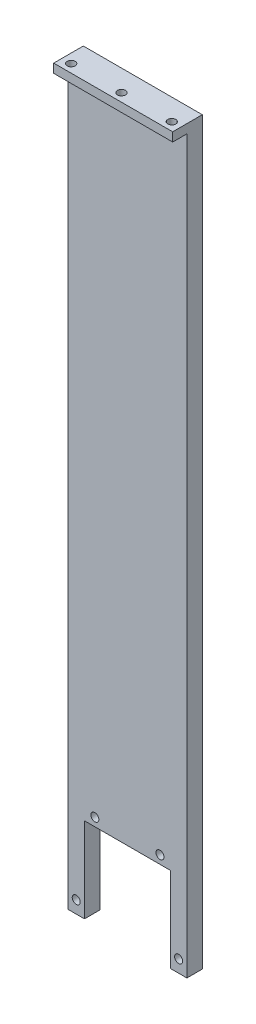
ISO-10303-21;
HEADER;
FILE_DESCRIPTION(('STEP AP214'),'2;1');
FILE_NAME('part.step','',(''),(''),'','','');
FILE_SCHEMA(('AUTOMOTIVE_DESIGN { 1 0 10303 214 1 1 1 1 }'));
ENDSEC;
DATA;
#1=APPLICATION_CONTEXT('core data for automotive mechanical design processes');
#2=APPLICATION_PROTOCOL_DEFINITION('international standard','automotive_design',2000,#1);
#3=PRODUCT_CONTEXT('',#1,'mechanical');
#4=PRODUCT('Part','Part','',(#3));
#5=PRODUCT_RELATED_PRODUCT_CATEGORY('part','',(#4));
#6=PRODUCT_DEFINITION_FORMATION('','',#4);
#7=PRODUCT_DEFINITION_CONTEXT('part definition',#1,'design');
#8=PRODUCT_DEFINITION('design','',#6,#7);
#9=PRODUCT_DEFINITION_SHAPE('','',#8);
#10=(LENGTH_UNIT() NAMED_UNIT(*) SI_UNIT(.MILLI.,.METRE.));
#11=(NAMED_UNIT(*) PLANE_ANGLE_UNIT() SI_UNIT($,.RADIAN.));
#12=(NAMED_UNIT(*) SI_UNIT($,.STERADIAN.) SOLID_ANGLE_UNIT());
#13=UNCERTAINTY_MEASURE_WITH_UNIT(LENGTH_MEASURE(1.E-05),#10,'distance_accuracy_value','');
#14=(GEOMETRIC_REPRESENTATION_CONTEXT(3) GLOBAL_UNCERTAINTY_ASSIGNED_CONTEXT((#13)) GLOBAL_UNIT_ASSIGNED_CONTEXT((#10,
#11,#12)) REPRESENTATION_CONTEXT('',''));
#15=CARTESIAN_POINT('',(0.,0.,0.));
#16=DIRECTION('',(0.,0.,1.));
#17=DIRECTION('',(1.,0.,0.));
#18=AXIS2_PLACEMENT_3D('',#15,#16,#17);
#19=CARTESIAN_POINT('',(-20.1,-125.,10.));
#20=DIRECTION('',(0.,1.,0.));
#21=DIRECTION('',(0.,0.,1.));
#22=AXIS2_PLACEMENT_3D('',#19,#20,#21);
#23=PLANE('',#22);
#24=DIRECTION('',(1.,0.,0.));
#25=VECTOR('',#24,1.);
#26=CARTESIAN_POINT('',(-20.1,-125.,5.2));
#27=LINE('',#26,#25);
#28=CARTESIAN_POINT('',(14.5,-125.,5.2));
#29=VERTEX_POINT('',#28);
#30=CARTESIAN_POINT('',(20.1,-125.,5.2));
#31=VERTEX_POINT('',#30);
#32=EDGE_CURVE('E152',#29,#31,#27,.T.);
#33=ORIENTED_EDGE('',*,*,#32,.F.);
#34=DIRECTION('',(0.,0.,1.));
#35=VECTOR('',#34,1.);
#36=CARTESIAN_POINT('',(14.5,-125.,0.));
#37=LINE('',#36,#35);
#38=CARTESIAN_POINT('',(14.5,-125.,0.));
#39=VERTEX_POINT('',#38);
#40=EDGE_CURVE('E137',#39,#29,#37,.T.);
#41=ORIENTED_EDGE('',*,*,#40,.F.);
#42=DIRECTION('',(1.,0.,0.));
#43=VECTOR('',#42,1.);
#44=CARTESIAN_POINT('',(-20.1,-125.,0.));
#45=LINE('',#44,#43);
#46=CARTESIAN_POINT('',(20.1,-125.,0.));
#47=VERTEX_POINT('',#46);
#48=EDGE_CURVE('E127',#39,#47,#45,.T.);
#49=ORIENTED_EDGE('',*,*,#48,.T.);
#50=DIRECTION('',(0.,0.,-1.));
#51=VECTOR('',#50,1.);
#52=CARTESIAN_POINT('',(20.1,-125.,10.));
#53=LINE('',#52,#51);
#54=EDGE_CURVE('E170',#31,#47,#53,.T.);
#55=ORIENTED_EDGE('',*,*,#54,.F.);
#56=EDGE_LOOP('',(#33,#41,#49,#55));
#57=FACE_BOUND('',#56,.T.);
#58=ADVANCED_FACE('F31',(#57),#23,.F.);
#59=CARTESIAN_POINT('',(-20.1,-125.,0.));
#60=VERTEX_POINT('',#59);
#61=CARTESIAN_POINT('',(-14.5,-125.,0.));
#62=VERTEX_POINT('',#61);
#63=EDGE_CURVE('E165',#60,#62,#45,.T.);
#64=ORIENTED_EDGE('',*,*,#63,.T.);
#65=DIRECTION('',(0.,0.,1.));
#66=VECTOR('',#65,1.);
#67=CARTESIAN_POINT('',(-14.5,-125.,0.));
#68=LINE('',#67,#66);
#69=CARTESIAN_POINT('',(-14.5,-125.,5.2));
#70=VERTEX_POINT('',#69);
#71=EDGE_CURVE('E140',#62,#70,#68,.T.);
#72=ORIENTED_EDGE('',*,*,#71,.T.);
#73=CARTESIAN_POINT('',(-20.1,-125.,5.2));
#74=VERTEX_POINT('',#73);
#75=EDGE_CURVE('E153',#74,#70,#27,.T.);
#76=ORIENTED_EDGE('',*,*,#75,.F.);
#77=DIRECTION('',(0.,0.,-1.));
#78=VECTOR('',#77,1.);
#79=CARTESIAN_POINT('',(-20.1,-125.,10.));
#80=LINE('',#79,#78);
#81=EDGE_CURVE('E182',#74,#60,#80,.T.);
#82=ORIENTED_EDGE('',*,*,#81,.T.);
#83=EDGE_LOOP('',(#64,#72,#76,#82));
#84=FACE_BOUND('',#83,.T.);
#85=ADVANCED_FACE('F247',(#84),#23,.F.);
#86=CARTESIAN_POINT('',(20.1,-125.,10.));
#87=DIRECTION('',(-1.,0.,0.));
#88=DIRECTION('',(0.,0.,1.));
#89=AXIS2_PLACEMENT_3D('',#86,#87,#88);
#90=PLANE('',#89);
#91=DIRECTION('',(0.,1.,0.));
#92=VECTOR('',#91,1.);
#93=CARTESIAN_POINT('',(20.1,-125.,10.));
#94=LINE('',#93,#92);
#95=CARTESIAN_POINT('',(20.1,122.,10.));
#96=VERTEX_POINT('',#95);
#97=CARTESIAN_POINT('',(20.1,125.,10.));
#98=VERTEX_POINT('',#97);
#99=EDGE_CURVE('E162',#96,#98,#94,.T.);
#100=ORIENTED_EDGE('',*,*,#99,.F.);
#101=DIRECTION('',(0.,0.,1.));
#102=VECTOR('',#101,1.);
#103=CARTESIAN_POINT('',(20.1,122.,5.2));
#104=LINE('',#103,#102);
#105=CARTESIAN_POINT('',(20.1,122.,5.2));
#106=VERTEX_POINT('',#105);
#107=EDGE_CURVE('E55',#106,#96,#104,.T.);
#108=ORIENTED_EDGE('',*,*,#107,.F.);
#109=DIRECTION('',(0.,1.,0.));
#110=VECTOR('',#109,1.);
#111=CARTESIAN_POINT('',(20.1,122.,5.2));
#112=LINE('',#111,#110);
#113=EDGE_CURVE('E144',#31,#106,#112,.T.);
#114=ORIENTED_EDGE('',*,*,#113,.F.);
#115=ORIENTED_EDGE('',*,*,#54,.T.);
#116=DIRECTION('',(0.,1.,0.));
#117=VECTOR('',#116,1.);
#118=CARTESIAN_POINT('',(20.1,-125.,0.));
#119=LINE('',#118,#117);
#120=CARTESIAN_POINT('',(20.1,125.,0.));
#121=VERTEX_POINT('',#120);
#122=EDGE_CURVE('E160',#47,#121,#119,.T.);
#123=ORIENTED_EDGE('',*,*,#122,.T.);
#124=DIRECTION('',(0.,0.,-1.));
#125=VECTOR('',#124,1.);
#126=CARTESIAN_POINT('',(20.1,125.,10.));
#127=LINE('',#126,#125);
#128=EDGE_CURVE('E187',#98,#121,#127,.T.);
#129=ORIENTED_EDGE('',*,*,#128,.F.);
#130=EDGE_LOOP('',(#100,#108,#114,#115,#123,#129));
#131=FACE_BOUND('',#130,.T.);
#132=ADVANCED_FACE('F33',(#131),#90,.F.);
#133=CARTESIAN_POINT('',(-20.1,125.,10.));
#134=DIRECTION('',(0.,-1.,0.));
#135=DIRECTION('',(0.,0.,-1.));
#136=AXIS2_PLACEMENT_3D('',#133,#134,#135);
#137=PLANE('',#136);
#138=CARTESIAN_POINT('',(0.,125.,7.2));
#139=DIRECTION('',(0.,1.,0.));
#140=DIRECTION('',(0.,0.,1.));
#141=AXIS2_PLACEMENT_3D('',#138,#139,#140);
#142=CIRCLE('',#141,1.35);
#143=CARTESIAN_POINT('',(0.,125.,8.55));
#144=VERTEX_POINT('',#143);
#145=EDGE_CURVE('E220',#144,#144,#142,.T.);
#146=ORIENTED_EDGE('',*,*,#145,.F.);
#147=EDGE_LOOP('',(#146));
#148=FACE_BOUND('',#147,.T.);
#149=CARTESIAN_POINT('',(-17.,125.,7.2));
#150=DIRECTION('',(0.,1.,0.));
#151=DIRECTION('',(0.,0.,1.));
#152=AXIS2_PLACEMENT_3D('',#149,#150,#151);
#153=CIRCLE('',#152,1.35);
#154=CARTESIAN_POINT('',(-17.,125.,8.55));
#155=VERTEX_POINT('',#154);
#156=EDGE_CURVE('E210',#155,#155,#153,.T.);
#157=ORIENTED_EDGE('',*,*,#156,.F.);
#158=EDGE_LOOP('',(#157));
#159=FACE_BOUND('',#158,.T.);
#160=CARTESIAN_POINT('',(17.,125.,7.2));
#161=DIRECTION('',(0.,1.,0.));
#162=DIRECTION('',(0.,0.,1.));
#163=AXIS2_PLACEMENT_3D('',#160,#161,#162);
#164=CIRCLE('',#163,1.35);
#165=CARTESIAN_POINT('',(17.,125.,8.55));
#166=VERTEX_POINT('',#165);
#167=EDGE_CURVE('E207',#166,#166,#164,.T.);
#168=ORIENTED_EDGE('',*,*,#167,.F.);
#169=EDGE_LOOP('',(#168));
#170=FACE_BOUND('',#169,.T.);
#171=DIRECTION('',(-1.,0.,0.));
#172=VECTOR('',#171,1.);
#173=CARTESIAN_POINT('',(-20.1,125.,0.));
#174=LINE('',#173,#172);
#175=CARTESIAN_POINT('',(-20.1,125.,0.));
#176=VERTEX_POINT('',#175);
#177=EDGE_CURVE('E173',#121,#176,#174,.T.);
#178=ORIENTED_EDGE('',*,*,#177,.T.);
#179=DIRECTION('',(0.,0.,-1.));
#180=VECTOR('',#179,1.);
#181=CARTESIAN_POINT('',(-20.1,125.,10.));
#182=LINE('',#181,#180);
#183=CARTESIAN_POINT('',(-20.1,125.,10.));
#184=VERTEX_POINT('',#183);
#185=EDGE_CURVE('E184',#184,#176,#182,.T.);
#186=ORIENTED_EDGE('',*,*,#185,.F.);
#187=DIRECTION('',(-1.,0.,0.));
#188=VECTOR('',#187,1.);
#189=CARTESIAN_POINT('',(-20.1,125.,10.));
#190=LINE('',#189,#188);
#191=EDGE_CURVE('E164',#98,#184,#190,.T.);
#192=ORIENTED_EDGE('',*,*,#191,.F.);
#193=ORIENTED_EDGE('',*,*,#128,.T.);
#194=EDGE_LOOP('',(#178,#186,#192,#193));
#195=FACE_BOUND('',#194,.T.);
#196=ADVANCED_FACE('F261',(#148,#159,#170,#195),#137,.F.);
#197=CARTESIAN_POINT('',(-20.1,-125.,10.));
#198=DIRECTION('',(1.,0.,0.));
#199=DIRECTION('',(0.,0.,-1.));
#200=AXIS2_PLACEMENT_3D('',#197,#198,#199);
#201=PLANE('',#200);
#202=DIRECTION('',(0.,-1.,0.));
#203=VECTOR('',#202,1.);
#204=CARTESIAN_POINT('',(-20.1,122.,5.2));
#205=LINE('',#204,#203);
#206=CARTESIAN_POINT('',(-20.1,122.,5.2));
#207=VERTEX_POINT('',#206);
#208=EDGE_CURVE('E150',#207,#74,#205,.T.);
#209=ORIENTED_EDGE('',*,*,#208,.F.);
#210=DIRECTION('',(0.,0.,1.));
#211=VECTOR('',#210,1.);
#212=CARTESIAN_POINT('',(-20.1,122.,5.2));
#213=LINE('',#212,#211);
#214=CARTESIAN_POINT('',(-20.1,122.,10.));
#215=VERTEX_POINT('',#214);
#216=EDGE_CURVE('E157',#207,#215,#213,.T.);
#217=ORIENTED_EDGE('',*,*,#216,.T.);
#218=DIRECTION('',(0.,-1.,0.));
#219=VECTOR('',#218,1.);
#220=CARTESIAN_POINT('',(-20.1,-125.,10.));
#221=LINE('',#220,#219);
#222=EDGE_CURVE('E167',#184,#215,#221,.T.);
#223=ORIENTED_EDGE('',*,*,#222,.F.);
#224=ORIENTED_EDGE('',*,*,#185,.T.);
#225=DIRECTION('',(0.,-1.,0.));
#226=VECTOR('',#225,1.);
#227=CARTESIAN_POINT('',(-20.1,-125.,0.));
#228=LINE('',#227,#226);
#229=EDGE_CURVE('E175',#176,#60,#228,.T.);
#230=ORIENTED_EDGE('',*,*,#229,.T.);
#231=ORIENTED_EDGE('',*,*,#81,.F.);
#232=EDGE_LOOP('',(#209,#217,#223,#224,#230,#231));
#233=FACE_BOUND('',#232,.T.);
#234=ADVANCED_FACE('F258',(#233),#201,.F.);
#235=CARTESIAN_POINT('',(20.1,125.,10.));
#236=DIRECTION('',(0.,0.,-1.));
#237=DIRECTION('',(-1.,0.,0.));
#238=AXIS2_PLACEMENT_3D('',#235,#236,#237);
#239=PLANE('',#238);
#240=ORIENTED_EDGE('',*,*,#222,.T.);
#241=DIRECTION('',(-1.,0.,0.));
#242=VECTOR('',#241,1.);
#243=CARTESIAN_POINT('',(-20.1,122.,10.));
#244=LINE('',#243,#242);
#245=EDGE_CURVE('E139',#96,#215,#244,.T.);
#246=ORIENTED_EDGE('',*,*,#245,.F.);
#247=ORIENTED_EDGE('',*,*,#99,.T.);
#248=ORIENTED_EDGE('',*,*,#191,.T.);
#249=EDGE_LOOP('',(#240,#246,#247,#248));
#250=FACE_BOUND('',#249,.T.);
#251=ADVANCED_FACE('F260',(#250),#239,.F.);
#252=CARTESIAN_POINT('',(20.1,125.,0.));
#253=DIRECTION('',(0.,0.,-1.));
#254=DIRECTION('',(-1.,0.,0.));
#255=AXIS2_PLACEMENT_3D('',#252,#253,#254);
#256=PLANE('',#255);
#257=CARTESIAN_POINT('',(-11.,-93.5,0.));
#258=DIRECTION('',(0.,0.,1.));
#259=DIRECTION('',(1.,0.,0.));
#260=AXIS2_PLACEMENT_3D('',#257,#258,#259);
#261=CIRCLE('',#260,1.35);
#262=CARTESIAN_POINT('',(-9.64999999999999,-93.5,0.));
#263=VERTEX_POINT('',#262);
#264=EDGE_CURVE('E204',#263,#263,#261,.T.);
#265=ORIENTED_EDGE('',*,*,#264,.T.);
#266=EDGE_LOOP('',(#265));
#267=FACE_BOUND('',#266,.T.);
#268=CARTESIAN_POINT('',(-17.3,-120.8,0.));
#269=DIRECTION('',(0.,0.,1.));
#270=DIRECTION('',(1.,0.,0.));
#271=AXIS2_PLACEMENT_3D('',#268,#269,#270);
#272=CIRCLE('',#271,1.35000000000001);
#273=CARTESIAN_POINT('',(-15.95,-120.8,0.));
#274=VERTEX_POINT('',#273);
#275=EDGE_CURVE('E200',#274,#274,#272,.T.);
#276=ORIENTED_EDGE('',*,*,#275,.T.);
#277=EDGE_LOOP('',(#276));
#278=FACE_BOUND('',#277,.T.);
#279=CARTESIAN_POINT('',(11.,-93.5,0.));
#280=DIRECTION('',(0.,0.,1.));
#281=DIRECTION('',(1.,0.,0.));
#282=AXIS2_PLACEMENT_3D('',#279,#280,#281);
#283=CIRCLE('',#282,1.35);
#284=CARTESIAN_POINT('',(12.35,-93.5,0.));
#285=VERTEX_POINT('',#284);
#286=EDGE_CURVE('E196',#285,#285,#283,.T.);
#287=ORIENTED_EDGE('',*,*,#286,.T.);
#288=EDGE_LOOP('',(#287));
#289=FACE_BOUND('',#288,.T.);
#290=CARTESIAN_POINT('',(17.3,-120.8,0.));
#291=DIRECTION('',(0.,0.,1.));
#292=DIRECTION('',(1.,0.,0.));
#293=AXIS2_PLACEMENT_3D('',#290,#291,#292);
#294=CIRCLE('',#293,1.35000000000001);
#295=CARTESIAN_POINT('',(18.65,-120.8,0.));
#296=VERTEX_POINT('',#295);
#297=EDGE_CURVE('E131',#296,#296,#294,.T.);
#298=ORIENTED_EDGE('',*,*,#297,.T.);
#299=EDGE_LOOP('',(#298));
#300=FACE_BOUND('',#299,.T.);
#301=DIRECTION('',(0.,1.,0.));
#302=VECTOR('',#301,1.);
#303=CARTESIAN_POINT('',(14.5,-96.3,0.));
#304=LINE('',#303,#302);
#305=CARTESIAN_POINT('',(14.5,-96.3,0.));
#306=VERTEX_POINT('',#305);
#307=EDGE_CURVE('E109',#39,#306,#304,.T.);
#308=ORIENTED_EDGE('',*,*,#307,.T.);
#309=DIRECTION('',(-1.,0.,0.));
#310=VECTOR('',#309,1.);
#311=CARTESIAN_POINT('',(-14.5,-96.3,0.));
#312=LINE('',#311,#310);
#313=CARTESIAN_POINT('',(-14.5,-96.3,0.));
#314=VERTEX_POINT('',#313);
#315=EDGE_CURVE('E117',#306,#314,#312,.T.);
#316=ORIENTED_EDGE('',*,*,#315,.T.);
#317=DIRECTION('',(0.,-1.,0.));
#318=VECTOR('',#317,1.);
#319=CARTESIAN_POINT('',(-14.5,-96.3,0.));
#320=LINE('',#319,#318);
#321=EDGE_CURVE('E114',#314,#62,#320,.T.);
#322=ORIENTED_EDGE('',*,*,#321,.T.);
#323=ORIENTED_EDGE('',*,*,#63,.F.);
#324=ORIENTED_EDGE('',*,*,#229,.F.);
#325=ORIENTED_EDGE('',*,*,#177,.F.);
#326=ORIENTED_EDGE('',*,*,#122,.F.);
#327=ORIENTED_EDGE('',*,*,#48,.F.);
#328=EDGE_LOOP('',(#308,#316,#322,#323,#324,#325,#326,#327));
#329=FACE_BOUND('',#328,.T.);
#330=ADVANCED_FACE('F125',(#267,#278,#289,#300,#329),#256,.T.);
#331=CARTESIAN_POINT('',(-20.1,122.,5.2));
#332=DIRECTION('',(0.,1.,0.));
#333=DIRECTION('',(0.,0.,1.));
#334=AXIS2_PLACEMENT_3D('',#331,#332,#333);
#335=PLANE('',#334);
#336=CARTESIAN_POINT('',(0.,122.,7.2));
#337=DIRECTION('',(0.,1.,0.));
#338=DIRECTION('',(0.,0.,1.));
#339=AXIS2_PLACEMENT_3D('',#336,#337,#338);
#340=CIRCLE('',#339,1.35);
#341=CARTESIAN_POINT('',(0.,122.,8.55));
#342=VERTEX_POINT('',#341);
#343=EDGE_CURVE('E35',#342,#342,#340,.T.);
#344=ORIENTED_EDGE('',*,*,#343,.T.);
#345=EDGE_LOOP('',(#344));
#346=FACE_BOUND('',#345,.T.);
#347=CARTESIAN_POINT('',(-17.,122.,7.2));
#348=DIRECTION('',(0.,1.,0.));
#349=DIRECTION('',(0.,0.,1.));
#350=AXIS2_PLACEMENT_3D('',#347,#348,#349);
#351=CIRCLE('',#350,1.35);
#352=CARTESIAN_POINT('',(-17.,122.,8.55));
#353=VERTEX_POINT('',#352);
#354=EDGE_CURVE('E208',#353,#353,#351,.T.);
#355=ORIENTED_EDGE('',*,*,#354,.T.);
#356=EDGE_LOOP('',(#355));
#357=FACE_BOUND('',#356,.T.);
#358=CARTESIAN_POINT('',(17.,122.,7.2));
#359=DIRECTION('',(0.,1.,0.));
#360=DIRECTION('',(0.,0.,1.));
#361=AXIS2_PLACEMENT_3D('',#358,#359,#360);
#362=CIRCLE('',#361,1.35);
#363=CARTESIAN_POINT('',(17.,122.,8.55));
#364=VERTEX_POINT('',#363);
#365=EDGE_CURVE('E205',#364,#364,#362,.T.);
#366=ORIENTED_EDGE('',*,*,#365,.T.);
#367=EDGE_LOOP('',(#366));
#368=FACE_BOUND('',#367,.T.);
#369=ORIENTED_EDGE('',*,*,#245,.T.);
#370=ORIENTED_EDGE('',*,*,#216,.F.);
#371=DIRECTION('',(-1.,0.,0.));
#372=VECTOR('',#371,1.);
#373=CARTESIAN_POINT('',(-20.1,122.,5.2));
#374=LINE('',#373,#372);
#375=EDGE_CURVE('E147',#106,#207,#374,.T.);
#376=ORIENTED_EDGE('',*,*,#375,.F.);
#377=ORIENTED_EDGE('',*,*,#107,.T.);
#378=EDGE_LOOP('',(#369,#370,#376,#377));
#379=FACE_BOUND('',#378,.T.);
#380=ADVANCED_FACE('F288',(#346,#357,#368,#379),#335,.F.);
#381=CARTESIAN_POINT('',(20.1,-125.,5.2));
#382=DIRECTION('',(0.,0.,1.));
#383=DIRECTION('',(1.,0.,0.));
#384=AXIS2_PLACEMENT_3D('',#381,#382,#383);
#385=PLANE('',#384);
#386=CARTESIAN_POINT('',(-11.,-93.5,5.2));
#387=DIRECTION('',(0.,0.,1.));
#388=DIRECTION('',(1.,0.,0.));
#389=AXIS2_PLACEMENT_3D('',#386,#387,#388);
#390=CIRCLE('',#389,1.35);
#391=CARTESIAN_POINT('',(-9.64999999999999,-93.5,5.2));
#392=VERTEX_POINT('',#391);
#393=EDGE_CURVE('E201',#392,#392,#390,.T.);
#394=ORIENTED_EDGE('',*,*,#393,.F.);
#395=EDGE_LOOP('',(#394));
#396=FACE_BOUND('',#395,.T.);
#397=CARTESIAN_POINT('',(-17.3,-120.8,5.2));
#398=DIRECTION('',(0.,0.,1.));
#399=DIRECTION('',(1.,0.,0.));
#400=AXIS2_PLACEMENT_3D('',#397,#398,#399);
#401=CIRCLE('',#400,1.35000000000001);
#402=CARTESIAN_POINT('',(-15.95,-120.8,5.2));
#403=VERTEX_POINT('',#402);
#404=EDGE_CURVE('E197',#403,#403,#401,.T.);
#405=ORIENTED_EDGE('',*,*,#404,.F.);
#406=EDGE_LOOP('',(#405));
#407=FACE_BOUND('',#406,.T.);
#408=CARTESIAN_POINT('',(11.,-93.5,5.2));
#409=DIRECTION('',(0.,0.,1.));
#410=DIRECTION('',(1.,0.,0.));
#411=AXIS2_PLACEMENT_3D('',#408,#409,#410);
#412=CIRCLE('',#411,1.35);
#413=CARTESIAN_POINT('',(12.35,-93.5,5.2));
#414=VERTEX_POINT('',#413);
#415=EDGE_CURVE('E193',#414,#414,#412,.T.);
#416=ORIENTED_EDGE('',*,*,#415,.F.);
#417=EDGE_LOOP('',(#416));
#418=FACE_BOUND('',#417,.T.);
#419=CARTESIAN_POINT('',(17.3,-120.8,5.2));
#420=DIRECTION('',(0.,0.,1.));
#421=DIRECTION('',(1.,0.,0.));
#422=AXIS2_PLACEMENT_3D('',#419,#420,#421);
#423=CIRCLE('',#422,1.35000000000001);
#424=CARTESIAN_POINT('',(18.65,-120.8,5.2));
#425=VERTEX_POINT('',#424);
#426=EDGE_CURVE('E128',#425,#425,#423,.T.);
#427=ORIENTED_EDGE('',*,*,#426,.F.);
#428=EDGE_LOOP('',(#427));
#429=FACE_BOUND('',#428,.T.);
#430=DIRECTION('',(0.,1.,0.));
#431=VECTOR('',#430,1.);
#432=CARTESIAN_POINT('',(14.5,-125.,5.2));
#433=LINE('',#432,#431);
#434=CARTESIAN_POINT('',(14.5,-96.3,5.2));
#435=VERTEX_POINT('',#434);
#436=EDGE_CURVE('E11',#29,#435,#433,.T.);
#437=ORIENTED_EDGE('',*,*,#436,.F.);
#438=ORIENTED_EDGE('',*,*,#32,.T.);
#439=ORIENTED_EDGE('',*,*,#113,.T.);
#440=ORIENTED_EDGE('',*,*,#375,.T.);
#441=ORIENTED_EDGE('',*,*,#208,.T.);
#442=ORIENTED_EDGE('',*,*,#75,.T.);
#443=DIRECTION('',(0.,-1.,0.));
#444=VECTOR('',#443,1.);
#445=CARTESIAN_POINT('',(-14.5,-125.,5.2));
#446=LINE('',#445,#444);
#447=CARTESIAN_POINT('',(-14.5,-96.3,5.2));
#448=VERTEX_POINT('',#447);
#449=EDGE_CURVE('E40',#448,#70,#446,.T.);
#450=ORIENTED_EDGE('',*,*,#449,.F.);
#451=DIRECTION('',(-1.,0.,0.));
#452=VECTOR('',#451,1.);
#453=CARTESIAN_POINT('',(20.1,-96.3,5.2));
#454=LINE('',#453,#452);
#455=EDGE_CURVE('E190',#435,#448,#454,.T.);
#456=ORIENTED_EDGE('',*,*,#455,.F.);
#457=EDGE_LOOP('',(#437,#438,#439,#440,#441,#442,#450,#456));
#458=FACE_BOUND('',#457,.T.);
#459=ADVANCED_FACE('F285',(#396,#407,#418,#429,#458),#385,.T.);
#460=CARTESIAN_POINT('',(14.5,-96.3,0.));
#461=DIRECTION('',(1.,0.,0.));
#462=DIRECTION('',(0.,1.,0.));
#463=AXIS2_PLACEMENT_3D('',#460,#461,#462);
#464=PLANE('',#463);
#465=ORIENTED_EDGE('',*,*,#436,.T.);
#466=DIRECTION('',(0.,0.,1.));
#467=VECTOR('',#466,1.);
#468=CARTESIAN_POINT('',(14.5,-96.3,0.));
#469=LINE('',#468,#467);
#470=EDGE_CURVE('E48',#306,#435,#469,.T.);
#471=ORIENTED_EDGE('',*,*,#470,.F.);
#472=ORIENTED_EDGE('',*,*,#307,.F.);
#473=ORIENTED_EDGE('',*,*,#40,.T.);
#474=EDGE_LOOP('',(#465,#471,#472,#473));
#475=FACE_BOUND('',#474,.T.);
#476=ADVANCED_FACE('F107',(#475),#464,.F.);
#477=CARTESIAN_POINT('',(-14.5,-96.3,0.));
#478=DIRECTION('',(-1.,0.,0.));
#479=DIRECTION('',(0.,-1.,0.));
#480=AXIS2_PLACEMENT_3D('',#477,#478,#479);
#481=PLANE('',#480);
#482=ORIENTED_EDGE('',*,*,#449,.T.);
#483=ORIENTED_EDGE('',*,*,#71,.F.);
#484=ORIENTED_EDGE('',*,*,#321,.F.);
#485=DIRECTION('',(0.,0.,1.));
#486=VECTOR('',#485,1.);
#487=CARTESIAN_POINT('',(-14.5,-96.3,0.));
#488=LINE('',#487,#486);
#489=EDGE_CURVE('E113',#314,#448,#488,.T.);
#490=ORIENTED_EDGE('',*,*,#489,.T.);
#491=EDGE_LOOP('',(#482,#483,#484,#490));
#492=FACE_BOUND('',#491,.T.);
#493=ADVANCED_FACE('F293',(#492),#481,.F.);
#494=CARTESIAN_POINT('',(-14.5,-96.3,0.));
#495=DIRECTION('',(0.,1.,0.));
#496=DIRECTION('',(0.,0.,1.));
#497=AXIS2_PLACEMENT_3D('',#494,#495,#496);
#498=PLANE('',#497);
#499=ORIENTED_EDGE('',*,*,#455,.T.);
#500=ORIENTED_EDGE('',*,*,#489,.F.);
#501=ORIENTED_EDGE('',*,*,#315,.F.);
#502=ORIENTED_EDGE('',*,*,#470,.T.);
#503=EDGE_LOOP('',(#499,#500,#501,#502));
#504=FACE_BOUND('',#503,.T.);
#505=ADVANCED_FACE('F118',(#504),#498,.F.);
#506=CARTESIAN_POINT('',(17.3,-120.8,0.));
#507=DIRECTION('',(0.,0.,1.));
#508=DIRECTION('',(1.,0.,0.));
#509=AXIS2_PLACEMENT_3D('',#506,#507,#508);
#510=CYLINDRICAL_SURFACE('',#509,1.35000000000001);
#511=ORIENTED_EDGE('',*,*,#426,.T.);
#512=EDGE_LOOP('',(#511));
#513=FACE_BOUND('',#512,.T.);
#514=ORIENTED_EDGE('',*,*,#297,.F.);
#515=EDGE_LOOP('',(#514));
#516=FACE_BOUND('',#515,.T.);
#517=ADVANCED_FACE('F234',(#513,#516),#510,.F.);
#518=CARTESIAN_POINT('',(11.,-93.5,0.));
#519=DIRECTION('',(0.,0.,1.));
#520=DIRECTION('',(1.,0.,0.));
#521=AXIS2_PLACEMENT_3D('',#518,#519,#520);
#522=CYLINDRICAL_SURFACE('',#521,1.35);
#523=ORIENTED_EDGE('',*,*,#415,.T.);
#524=EDGE_LOOP('',(#523));
#525=FACE_BOUND('',#524,.T.);
#526=ORIENTED_EDGE('',*,*,#286,.F.);
#527=EDGE_LOOP('',(#526));
#528=FACE_BOUND('',#527,.T.);
#529=ADVANCED_FACE('F231',(#525,#528),#522,.F.);
#530=CARTESIAN_POINT('',(-17.3,-120.8,0.));
#531=DIRECTION('',(0.,0.,1.));
#532=DIRECTION('',(1.,0.,0.));
#533=AXIS2_PLACEMENT_3D('',#530,#531,#532);
#534=CYLINDRICAL_SURFACE('',#533,1.35000000000001);
#535=ORIENTED_EDGE('',*,*,#404,.T.);
#536=EDGE_LOOP('',(#535));
#537=FACE_BOUND('',#536,.T.);
#538=ORIENTED_EDGE('',*,*,#275,.F.);
#539=EDGE_LOOP('',(#538));
#540=FACE_BOUND('',#539,.T.);
#541=ADVANCED_FACE('F233',(#537,#540),#534,.F.);
#542=CARTESIAN_POINT('',(-11.,-93.5,0.));
#543=DIRECTION('',(0.,0.,1.));
#544=DIRECTION('',(1.,0.,0.));
#545=AXIS2_PLACEMENT_3D('',#542,#543,#544);
#546=CYLINDRICAL_SURFACE('',#545,1.35);
#547=ORIENTED_EDGE('',*,*,#393,.T.);
#548=EDGE_LOOP('',(#547));
#549=FACE_BOUND('',#548,.T.);
#550=ORIENTED_EDGE('',*,*,#264,.F.);
#551=EDGE_LOOP('',(#550));
#552=FACE_BOUND('',#551,.T.);
#553=ADVANCED_FACE('F241',(#549,#552),#546,.F.);
#554=CARTESIAN_POINT('',(17.,-125.,7.2));
#555=DIRECTION('',(0.,1.,0.));
#556=DIRECTION('',(0.,0.,1.));
#557=AXIS2_PLACEMENT_3D('',#554,#555,#556);
#558=CYLINDRICAL_SURFACE('',#557,1.35);
#559=ORIENTED_EDGE('',*,*,#167,.T.);
#560=EDGE_LOOP('',(#559));
#561=FACE_BOUND('',#560,.T.);
#562=ORIENTED_EDGE('',*,*,#365,.F.);
#563=EDGE_LOOP('',(#562));
#564=FACE_BOUND('',#563,.T.);
#565=ADVANCED_FACE('F321',(#561,#564),#558,.F.);
#566=CARTESIAN_POINT('',(-17.,-125.,7.2));
#567=DIRECTION('',(0.,1.,0.));
#568=DIRECTION('',(0.,0.,1.));
#569=AXIS2_PLACEMENT_3D('',#566,#567,#568);
#570=CYLINDRICAL_SURFACE('',#569,1.35);
#571=ORIENTED_EDGE('',*,*,#156,.T.);
#572=EDGE_LOOP('',(#571));
#573=FACE_BOUND('',#572,.T.);
#574=ORIENTED_EDGE('',*,*,#354,.F.);
#575=EDGE_LOOP('',(#574));
#576=FACE_BOUND('',#575,.T.);
#577=ADVANCED_FACE('F327',(#573,#576),#570,.F.);
#578=CARTESIAN_POINT('',(0.,-125.,7.2));
#579=DIRECTION('',(0.,1.,0.));
#580=DIRECTION('',(0.,0.,1.));
#581=AXIS2_PLACEMENT_3D('',#578,#579,#580);
#582=CYLINDRICAL_SURFACE('',#581,1.35);
#583=ORIENTED_EDGE('',*,*,#145,.T.);
#584=EDGE_LOOP('',(#583));
#585=FACE_BOUND('',#584,.T.);
#586=ORIENTED_EDGE('',*,*,#343,.F.);
#587=EDGE_LOOP('',(#586));
#588=FACE_BOUND('',#587,.T.);
#589=ADVANCED_FACE('F333',(#585,#588),#582,.F.);
#590=CLOSED_SHELL('',(#58,#85,#132,#196,#234,#251,#330,#380,#459,#476,#493,#505,#517,#529,#541,
#553,#565,#577,#589));
#591=MANIFOLD_SOLID_BREP('B2',#590);
#592=ADVANCED_BREP_SHAPE_REPRESENTATION('',(#18,#591),#14);
#593=SHAPE_DEFINITION_REPRESENTATION(#9,#592);
ENDSEC;
END-ISO-10303-21;
